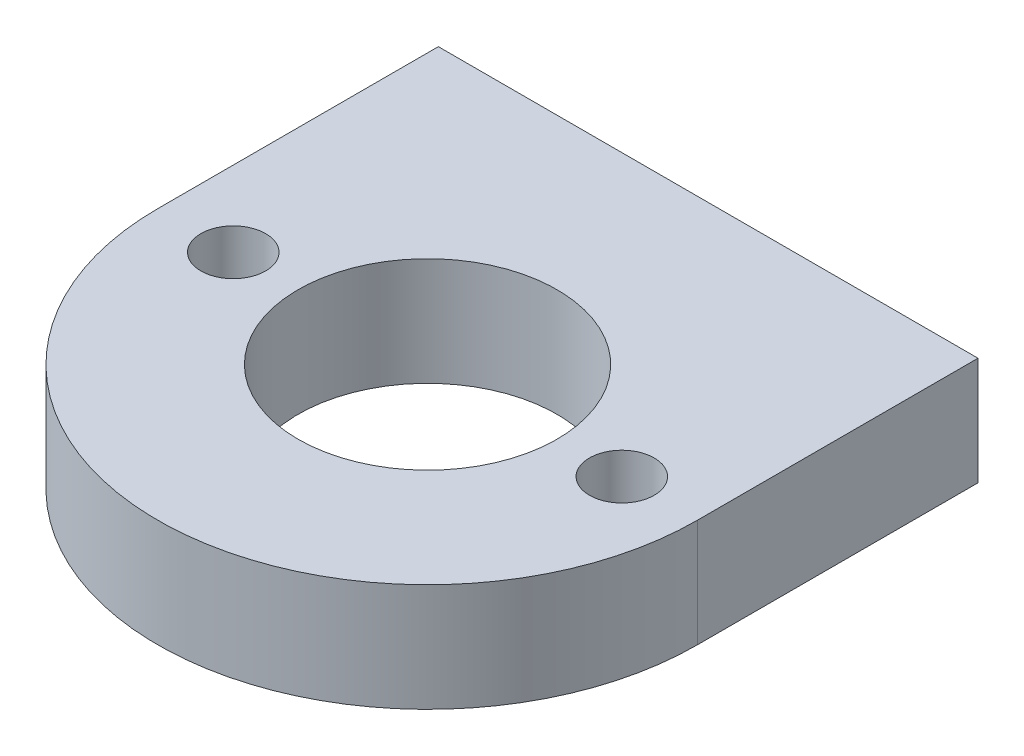
ISO-10303-21;
HEADER;
FILE_DESCRIPTION(('STEP AP214'),'2;1');
FILE_NAME('part.step','',(''),(''),'','','');
FILE_SCHEMA(('AUTOMOTIVE_DESIGN { 1 0 10303 214 1 1 1 1 }'));
ENDSEC;
DATA;
#1=APPLICATION_CONTEXT('core data for automotive mechanical design processes');
#2=APPLICATION_PROTOCOL_DEFINITION('international standard','automotive_design',2000,#1);
#3=PRODUCT_CONTEXT('',#1,'mechanical');
#4=PRODUCT('Part','Part','',(#3));
#5=PRODUCT_RELATED_PRODUCT_CATEGORY('part','',(#4));
#6=PRODUCT_DEFINITION_FORMATION('','',#4);
#7=PRODUCT_DEFINITION_CONTEXT('part definition',#1,'design');
#8=PRODUCT_DEFINITION('design','',#6,#7);
#9=PRODUCT_DEFINITION_SHAPE('','',#8);
#10=(LENGTH_UNIT() NAMED_UNIT(*) SI_UNIT(.MILLI.,.METRE.));
#11=(NAMED_UNIT(*) PLANE_ANGLE_UNIT() SI_UNIT($,.RADIAN.));
#12=(NAMED_UNIT(*) SI_UNIT($,.STERADIAN.) SOLID_ANGLE_UNIT());
#13=UNCERTAINTY_MEASURE_WITH_UNIT(LENGTH_MEASURE(1.E-05),#10,'distance_accuracy_value','');
#14=(GEOMETRIC_REPRESENTATION_CONTEXT(3) GLOBAL_UNCERTAINTY_ASSIGNED_CONTEXT((#13)) GLOBAL_UNIT_ASSIGNED_CONTEXT((#10,
#11,#12)) REPRESENTATION_CONTEXT('',''));
#15=CARTESIAN_POINT('',(0.,0.,0.));
#16=DIRECTION('',(0.,0.,1.));
#17=DIRECTION('',(1.,0.,0.));
#18=AXIS2_PLACEMENT_3D('',#15,#16,#17);
#19=CARTESIAN_POINT('',(12.5,2.5,13.));
#20=DIRECTION('',(-1.,0.,0.));
#21=DIRECTION('',(0.,0.,1.));
#22=AXIS2_PLACEMENT_3D('',#19,#20,#21);
#23=PLANE('',#22);
#24=DIRECTION('',(0.,1.,0.));
#25=VECTOR('',#24,1.);
#26=CARTESIAN_POINT('',(12.5,2.5,0.));
#27=LINE('',#26,#25);
#28=CARTESIAN_POINT('',(12.5,-2.5,0.));
#29=VERTEX_POINT('',#28);
#30=CARTESIAN_POINT('',(12.5,2.5,0.));
#31=VERTEX_POINT('',#30);
#32=EDGE_CURVE('E132',#29,#31,#27,.T.);
#33=ORIENTED_EDGE('',*,*,#32,.T.);
#34=DIRECTION('',(0.,0.,-1.));
#35=VECTOR('',#34,1.);
#36=CARTESIAN_POINT('',(12.5,2.5,13.));
#37=LINE('',#36,#35);
#38=CARTESIAN_POINT('',(12.5,2.5,13.));
#39=VERTEX_POINT('',#38);
#40=EDGE_CURVE('E11',#39,#31,#37,.T.);
#41=ORIENTED_EDGE('',*,*,#40,.F.);
#42=DIRECTION('',(0.,1.,0.));
#43=VECTOR('',#42,1.);
#44=CARTESIAN_POINT('',(12.5,2.5,13.));
#45=LINE('',#44,#43);
#46=CARTESIAN_POINT('',(12.5,-2.5,13.));
#47=VERTEX_POINT('',#46);
#48=EDGE_CURVE('E135',#47,#39,#45,.T.);
#49=ORIENTED_EDGE('',*,*,#48,.F.);
#50=DIRECTION('',(0.,0.,-1.));
#51=VECTOR('',#50,1.);
#52=CARTESIAN_POINT('',(12.5,-2.5,13.));
#53=LINE('',#52,#51);
#54=EDGE_CURVE('E139',#47,#29,#53,.T.);
#55=ORIENTED_EDGE('',*,*,#54,.T.);
#56=EDGE_LOOP('',(#33,#41,#49,#55));
#57=FACE_BOUND('',#56,.T.);
#58=ADVANCED_FACE('F37',(#57),#23,.F.);
#59=CARTESIAN_POINT('',(-12.5,2.5,13.));
#60=DIRECTION('',(0.,-1.,0.));
#61=DIRECTION('',(0.,0.,-1.));
#62=AXIS2_PLACEMENT_3D('',#59,#60,#61);
#63=PLANE('',#62);
#64=CARTESIAN_POINT('',(-9.00000000000001,2.5,13.));
#65=DIRECTION('',(0.,1.,0.));
#66=DIRECTION('',(0.,0.,1.));
#67=AXIS2_PLACEMENT_3D('',#64,#65,#66);
#68=CIRCLE('',#67,1.5);
#69=CARTESIAN_POINT('',(-9.00000000000001,2.5,14.5));
#70=VERTEX_POINT('',#69);
#71=EDGE_CURVE('E111',#70,#70,#68,.T.);
#72=ORIENTED_EDGE('',*,*,#71,.F.);
#73=EDGE_LOOP('',(#72));
#74=FACE_BOUND('',#73,.T.);
#75=CARTESIAN_POINT('',(8.99999999999999,2.5,13.));
#76=DIRECTION('',(0.,1.,0.));
#77=DIRECTION('',(0.,0.,1.));
#78=AXIS2_PLACEMENT_3D('',#75,#76,#77);
#79=CIRCLE('',#78,1.5);
#80=CARTESIAN_POINT('',(8.99999999999999,2.5,14.5));
#81=VERTEX_POINT('',#80);
#82=EDGE_CURVE('E114',#81,#81,#79,.T.);
#83=ORIENTED_EDGE('',*,*,#82,.F.);
#84=EDGE_LOOP('',(#83));
#85=FACE_BOUND('',#84,.T.);
#86=CARTESIAN_POINT('',(0.,2.5,13.));
#87=DIRECTION('',(0.,1.,0.));
#88=DIRECTION('',(0.,0.,1.));
#89=AXIS2_PLACEMENT_3D('',#86,#87,#88);
#90=CIRCLE('',#89,6.);
#91=CARTESIAN_POINT('',(0.,2.5,19.));
#92=VERTEX_POINT('',#91);
#93=EDGE_CURVE('E120',#92,#92,#90,.T.);
#94=ORIENTED_EDGE('',*,*,#93,.F.);
#95=EDGE_LOOP('',(#94));
#96=FACE_BOUND('',#95,.T.);
#97=DIRECTION('',(0.,0.,-1.));
#98=VECTOR('',#97,1.);
#99=CARTESIAN_POINT('',(-12.5,2.5,13.));
#100=LINE('',#99,#98);
#101=CARTESIAN_POINT('',(-12.5,2.5,13.));
#102=VERTEX_POINT('',#101);
#103=CARTESIAN_POINT('',(-12.5,2.5,0.));
#104=VERTEX_POINT('',#103);
#105=EDGE_CURVE('E45',#102,#104,#100,.T.);
#106=ORIENTED_EDGE('',*,*,#105,.F.);
#107=CARTESIAN_POINT('',(0.,2.5,13.));
#108=DIRECTION('',(0.,-1.,0.));
#109=DIRECTION('',(0.,0.,-1.));
#110=AXIS2_PLACEMENT_3D('',#107,#108,#109);
#111=CIRCLE('',#110,12.5);
#112=EDGE_CURVE('E129',#39,#102,#111,.T.);
#113=ORIENTED_EDGE('',*,*,#112,.F.);
#114=ORIENTED_EDGE('',*,*,#40,.T.);
#115=DIRECTION('',(-1.,0.,0.));
#116=VECTOR('',#115,1.);
#117=CARTESIAN_POINT('',(-12.5,2.5,0.));
#118=LINE('',#117,#116);
#119=EDGE_CURVE('E141',#31,#104,#118,.T.);
#120=ORIENTED_EDGE('',*,*,#119,.T.);
#121=EDGE_LOOP('',(#106,#113,#114,#120));
#122=FACE_BOUND('',#121,.T.);
#123=ADVANCED_FACE('F156',(#74,#85,#96,#122),#63,.F.);
#124=CARTESIAN_POINT('',(-12.5,2.5,13.));
#125=DIRECTION('',(1.,0.,0.));
#126=DIRECTION('',(0.,0.,-1.));
#127=AXIS2_PLACEMENT_3D('',#124,#125,#126);
#128=PLANE('',#127);
#129=DIRECTION('',(0.,-1.,0.));
#130=VECTOR('',#129,1.);
#131=CARTESIAN_POINT('',(-12.5,2.5,0.));
#132=LINE('',#131,#130);
#133=CARTESIAN_POINT('',(-12.5,-2.5,0.));
#134=VERTEX_POINT('',#133);
#135=EDGE_CURVE('E69',#104,#134,#132,.T.);
#136=ORIENTED_EDGE('',*,*,#135,.T.);
#137=DIRECTION('',(0.,0.,-1.));
#138=VECTOR('',#137,1.);
#139=CARTESIAN_POINT('',(-12.5,-2.5,13.));
#140=LINE('',#139,#138);
#141=CARTESIAN_POINT('',(-12.5,-2.5,13.));
#142=VERTEX_POINT('',#141);
#143=EDGE_CURVE('E53',#142,#134,#140,.T.);
#144=ORIENTED_EDGE('',*,*,#143,.F.);
#145=DIRECTION('',(0.,-1.,0.));
#146=VECTOR('',#145,1.);
#147=CARTESIAN_POINT('',(-12.5,2.5,13.));
#148=LINE('',#147,#146);
#149=EDGE_CURVE('E137',#102,#142,#148,.T.);
#150=ORIENTED_EDGE('',*,*,#149,.F.);
#151=ORIENTED_EDGE('',*,*,#105,.T.);
#152=EDGE_LOOP('',(#136,#144,#150,#151));
#153=FACE_BOUND('',#152,.T.);
#154=ADVANCED_FACE('F146',(#153),#128,.F.);
#155=CARTESIAN_POINT('',(-12.5,-2.5,13.));
#156=DIRECTION('',(0.,1.,0.));
#157=DIRECTION('',(0.,0.,1.));
#158=AXIS2_PLACEMENT_3D('',#155,#156,#157);
#159=PLANE('',#158);
#160=CARTESIAN_POINT('',(-9.00000000000001,-2.5,13.));
#161=DIRECTION('',(0.,1.,0.));
#162=DIRECTION('',(0.,0.,1.));
#163=AXIS2_PLACEMENT_3D('',#160,#161,#162);
#164=CIRCLE('',#163,1.5);
#165=CARTESIAN_POINT('',(-9.00000000000001,-2.5,14.5));
#166=VERTEX_POINT('',#165);
#167=EDGE_CURVE('E110',#166,#166,#164,.T.);
#168=ORIENTED_EDGE('',*,*,#167,.T.);
#169=EDGE_LOOP('',(#168));
#170=FACE_BOUND('',#169,.T.);
#171=CARTESIAN_POINT('',(8.99999999999999,-2.5,13.));
#172=DIRECTION('',(0.,1.,0.));
#173=DIRECTION('',(0.,0.,1.));
#174=AXIS2_PLACEMENT_3D('',#171,#172,#173);
#175=CIRCLE('',#174,1.5);
#176=CARTESIAN_POINT('',(8.99999999999999,-2.5,14.5));
#177=VERTEX_POINT('',#176);
#178=EDGE_CURVE('E117',#177,#177,#175,.T.);
#179=ORIENTED_EDGE('',*,*,#178,.T.);
#180=EDGE_LOOP('',(#179));
#181=FACE_BOUND('',#180,.T.);
#182=CARTESIAN_POINT('',(0.,-2.5,13.));
#183=DIRECTION('',(0.,1.,0.));
#184=DIRECTION('',(0.,0.,1.));
#185=AXIS2_PLACEMENT_3D('',#182,#183,#184);
#186=CIRCLE('',#185,6.);
#187=CARTESIAN_POINT('',(0.,-2.5,19.));
#188=VERTEX_POINT('',#187);
#189=EDGE_CURVE('E123',#188,#188,#186,.T.);
#190=ORIENTED_EDGE('',*,*,#189,.T.);
#191=EDGE_LOOP('',(#190));
#192=FACE_BOUND('',#191,.T.);
#193=ORIENTED_EDGE('',*,*,#54,.F.);
#194=CARTESIAN_POINT('',(0.,-2.5,13.));
#195=DIRECTION('',(0.,-1.,0.));
#196=DIRECTION('',(0.,0.,-1.));
#197=AXIS2_PLACEMENT_3D('',#194,#195,#196);
#198=CIRCLE('',#197,12.5);
#199=EDGE_CURVE('E126',#47,#142,#198,.T.);
#200=ORIENTED_EDGE('',*,*,#199,.T.);
#201=ORIENTED_EDGE('',*,*,#143,.T.);
#202=DIRECTION('',(1.,0.,0.));
#203=VECTOR('',#202,1.);
#204=CARTESIAN_POINT('',(-12.5,-2.5,0.));
#205=LINE('',#204,#203);
#206=EDGE_CURVE('E74',#134,#29,#205,.T.);
#207=ORIENTED_EDGE('',*,*,#206,.T.);
#208=EDGE_LOOP('',(#193,#200,#201,#207));
#209=FACE_BOUND('',#208,.T.);
#210=ADVANCED_FACE('F153',(#170,#181,#192,#209),#159,.F.);
#211=CARTESIAN_POINT('',(0.,0.,0.));
#212=DIRECTION('',(0.,0.,1.));
#213=DIRECTION('',(1.,0.,0.));
#214=AXIS2_PLACEMENT_3D('',#211,#212,#213);
#215=PLANE('',#214);
#216=CARTESIAN_POINT('',(9.,0.,0.));
#217=DIRECTION('',(0.,0.,-1.));
#218=DIRECTION('',(-1.,0.,0.));
#219=AXIS2_PLACEMENT_3D('',#216,#217,#218);
#220=CIRCLE('',#219,1.24999999999999);
#221=CARTESIAN_POINT('',(7.75000000000001,0.,0.));
#222=VERTEX_POINT('',#221);
#223=EDGE_CURVE('E100',#222,#222,#220,.T.);
#224=ORIENTED_EDGE('',*,*,#223,.F.);
#225=EDGE_LOOP('',(#224));
#226=FACE_BOUND('',#225,.T.);
#227=CARTESIAN_POINT('',(-9.,0.,0.));
#228=DIRECTION('',(0.,0.,-1.));
#229=DIRECTION('',(-1.,0.,0.));
#230=AXIS2_PLACEMENT_3D('',#227,#228,#229);
#231=CIRCLE('',#230,1.24999999999999);
#232=CARTESIAN_POINT('',(-10.25,0.,0.));
#233=VERTEX_POINT('',#232);
#234=EDGE_CURVE('E99',#233,#233,#231,.T.);
#235=ORIENTED_EDGE('',*,*,#234,.F.);
#236=EDGE_LOOP('',(#235));
#237=FACE_BOUND('',#236,.T.);
#238=ORIENTED_EDGE('',*,*,#32,.F.);
#239=ORIENTED_EDGE('',*,*,#206,.F.);
#240=ORIENTED_EDGE('',*,*,#135,.F.);
#241=ORIENTED_EDGE('',*,*,#119,.F.);
#242=EDGE_LOOP('',(#238,#239,#240,#241));
#243=FACE_BOUND('',#242,.T.);
#244=ADVANCED_FACE('F151',(#226,#237,#243),#215,.F.);
#245=CARTESIAN_POINT('',(0.,2.5,13.));
#246=DIRECTION('',(0.,-1.,0.));
#247=DIRECTION('',(0.,0.,-1.));
#248=AXIS2_PLACEMENT_3D('',#245,#246,#247);
#249=CYLINDRICAL_SURFACE('',#248,12.5);
#250=ORIENTED_EDGE('',*,*,#112,.T.);
#251=ORIENTED_EDGE('',*,*,#149,.T.);
#252=ORIENTED_EDGE('',*,*,#199,.F.);
#253=ORIENTED_EDGE('',*,*,#48,.T.);
#254=EDGE_LOOP('',(#250,#251,#252,#253));
#255=FACE_BOUND('',#254,.T.);
#256=ADVANCED_FACE('F155',(#255),#249,.T.);
#257=CARTESIAN_POINT('',(0.,-2.5,13.));
#258=DIRECTION('',(0.,1.,0.));
#259=DIRECTION('',(0.,0.,1.));
#260=AXIS2_PLACEMENT_3D('',#257,#258,#259);
#261=CYLINDRICAL_SURFACE('',#260,6.);
#262=ORIENTED_EDGE('',*,*,#189,.F.);
#263=EDGE_LOOP('',(#262));
#264=FACE_BOUND('',#263,.T.);
#265=ORIENTED_EDGE('',*,*,#93,.T.);
#266=EDGE_LOOP('',(#265));
#267=FACE_BOUND('',#266,.T.);
#268=ADVANCED_FACE('F175',(#264,#267),#261,.F.);
#269=CARTESIAN_POINT('',(8.99999999999999,-2.5,13.));
#270=DIRECTION('',(0.,1.,0.));
#271=DIRECTION('',(0.,0.,1.));
#272=AXIS2_PLACEMENT_3D('',#269,#270,#271);
#273=CYLINDRICAL_SURFACE('',#272,1.5);
#274=ORIENTED_EDGE('',*,*,#178,.F.);
#275=EDGE_LOOP('',(#274));
#276=FACE_BOUND('',#275,.T.);
#277=ORIENTED_EDGE('',*,*,#82,.T.);
#278=EDGE_LOOP('',(#277));
#279=FACE_BOUND('',#278,.T.);
#280=ADVANCED_FACE('F178',(#276,#279),#273,.F.);
#281=CARTESIAN_POINT('',(-9.00000000000001,-2.5,13.));
#282=DIRECTION('',(0.,1.,0.));
#283=DIRECTION('',(0.,0.,1.));
#284=AXIS2_PLACEMENT_3D('',#281,#282,#283);
#285=CYLINDRICAL_SURFACE('',#284,1.5);
#286=ORIENTED_EDGE('',*,*,#167,.F.);
#287=EDGE_LOOP('',(#286));
#288=FACE_BOUND('',#287,.T.);
#289=ORIENTED_EDGE('',*,*,#71,.T.);
#290=EDGE_LOOP('',(#289));
#291=FACE_BOUND('',#290,.T.);
#292=ADVANCED_FACE('F182',(#288,#291),#285,.F.);
#293=CARTESIAN_POINT('',(-9.,0.,9.99999999999999));
#294=DIRECTION('',(0.,0.,-1.));
#295=DIRECTION('',(-1.,0.,0.));
#296=AXIS2_PLACEMENT_3D('',#293,#294,#295);
#297=CONICAL_SURFACE('',#296,1.24999999999999,1.02974425867664);
#298=CARTESIAN_POINT('',(-9.,0.,10.7510757737845));
#299=VERTEX_POINT('',#298);
#300=VERTEX_LOOP('',#299);
#301=FACE_BOUND('',#300,.T.);
#302=CARTESIAN_POINT('',(-9.,0.,9.99999999999999));
#303=DIRECTION('',(0.,0.,-1.));
#304=DIRECTION('',(-1.,0.,0.));
#305=AXIS2_PLACEMENT_3D('',#302,#303,#304);
#306=CIRCLE('',#305,1.24999999999999);
#307=CARTESIAN_POINT('',(-10.25,0.,9.99999999999999));
#308=VERTEX_POINT('',#307);
#309=EDGE_CURVE('E103',#308,#308,#306,.T.);
#310=ORIENTED_EDGE('',*,*,#309,.T.);
#311=EDGE_LOOP('',(#310));
#312=FACE_BOUND('',#311,.T.);
#313=ADVANCED_FACE('F186',(#301,#312),#297,.F.);
#314=CARTESIAN_POINT('',(-9.,0.,0.));
#315=DIRECTION('',(0.,0.,-1.));
#316=DIRECTION('',(-1.,0.,0.));
#317=AXIS2_PLACEMENT_3D('',#314,#315,#316);
#318=CYLINDRICAL_SURFACE('',#317,1.24999999999999);
#319=ORIENTED_EDGE('',*,*,#309,.F.);
#320=EDGE_LOOP('',(#319));
#321=FACE_BOUND('',#320,.T.);
#322=ORIENTED_EDGE('',*,*,#234,.T.);
#323=EDGE_LOOP('',(#322));
#324=FACE_BOUND('',#323,.T.);
#325=ADVANCED_FACE('F93',(#321,#324),#318,.F.);
#326=CARTESIAN_POINT('',(9.,0.,9.99999999999999));
#327=DIRECTION('',(0.,0.,-1.));
#328=DIRECTION('',(-1.,0.,0.));
#329=AXIS2_PLACEMENT_3D('',#326,#327,#328);
#330=CONICAL_SURFACE('',#329,1.24999999999999,1.02974425867664);
#331=CARTESIAN_POINT('',(9.,0.,10.7510757737845));
#332=VERTEX_POINT('',#331);
#333=VERTEX_LOOP('',#332);
#334=FACE_BOUND('',#333,.T.);
#335=CARTESIAN_POINT('',(9.,0.,9.99999999999999));
#336=DIRECTION('',(0.,0.,-1.));
#337=DIRECTION('',(-1.,0.,0.));
#338=AXIS2_PLACEMENT_3D('',#335,#336,#337);
#339=CIRCLE('',#338,1.24999999999999);
#340=CARTESIAN_POINT('',(7.75000000000001,0.,9.99999999999999));
#341=VERTEX_POINT('',#340);
#342=EDGE_CURVE('E97',#341,#341,#339,.T.);
#343=ORIENTED_EDGE('',*,*,#342,.T.);
#344=EDGE_LOOP('',(#343));
#345=FACE_BOUND('',#344,.T.);
#346=ADVANCED_FACE('F89',(#334,#345),#330,.F.);
#347=CARTESIAN_POINT('',(9.,0.,0.));
#348=DIRECTION('',(0.,0.,-1.));
#349=DIRECTION('',(-1.,0.,0.));
#350=AXIS2_PLACEMENT_3D('',#347,#348,#349);
#351=CYLINDRICAL_SURFACE('',#350,1.24999999999999);
#352=ORIENTED_EDGE('',*,*,#342,.F.);
#353=EDGE_LOOP('',(#352));
#354=FACE_BOUND('',#353,.T.);
#355=ORIENTED_EDGE('',*,*,#223,.T.);
#356=EDGE_LOOP('',(#355));
#357=FACE_BOUND('',#356,.T.);
#358=ADVANCED_FACE('F92',(#354,#357),#351,.F.);
#359=CLOSED_SHELL('',(#58,#123,#154,#210,#244,#256,#268,#280,#292,#313,#325,#346,#358));
#360=MANIFOLD_SOLID_BREP('B2',#359);
#361=ADVANCED_BREP_SHAPE_REPRESENTATION('',(#18,#360),#14);
#362=SHAPE_DEFINITION_REPRESENTATION(#9,#361);
ENDSEC;
END-ISO-10303-21;
